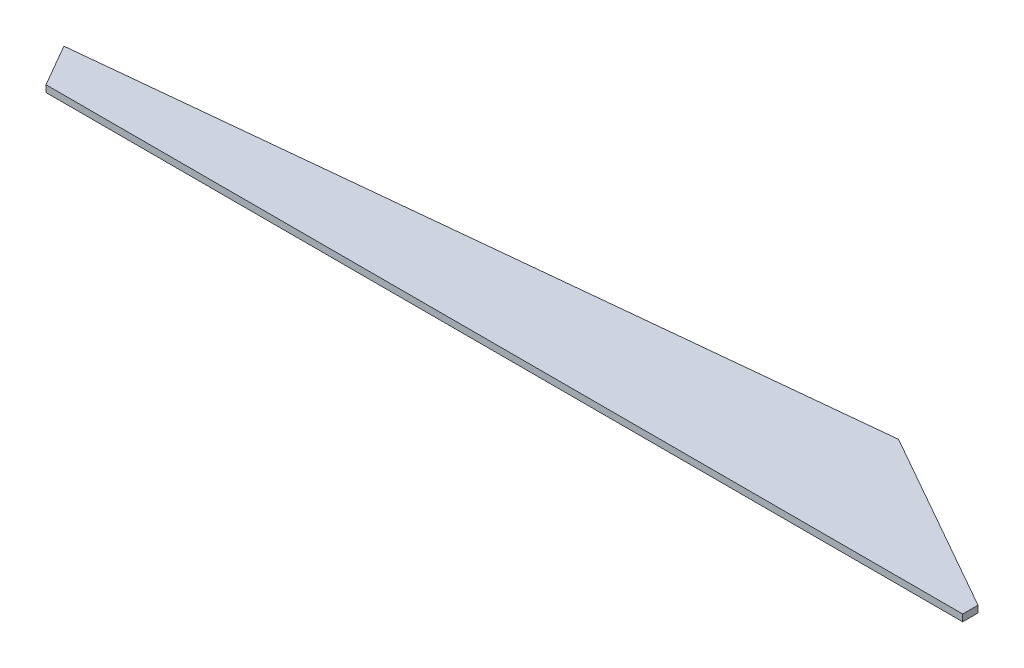
ISO-10303-21;
HEADER;
FILE_DESCRIPTION(('STEP AP214'),'2;1');
FILE_NAME('part.step','',(''),(''),'','','');
FILE_SCHEMA(('AUTOMOTIVE_DESIGN { 1 0 10303 214 1 1 1 1 }'));
ENDSEC;
DATA;
#1=APPLICATION_CONTEXT('core data for automotive mechanical design processes');
#2=APPLICATION_PROTOCOL_DEFINITION('international standard','automotive_design',2000,#1);
#3=PRODUCT_CONTEXT('',#1,'mechanical');
#4=PRODUCT('Part','Part','',(#3));
#5=PRODUCT_RELATED_PRODUCT_CATEGORY('part','',(#4));
#6=PRODUCT_DEFINITION_FORMATION('','',#4);
#7=PRODUCT_DEFINITION_CONTEXT('part definition',#1,'design');
#8=PRODUCT_DEFINITION('design','',#6,#7);
#9=PRODUCT_DEFINITION_SHAPE('','',#8);
#10=(LENGTH_UNIT() NAMED_UNIT(*) SI_UNIT(.MILLI.,.METRE.));
#11=(NAMED_UNIT(*) PLANE_ANGLE_UNIT() SI_UNIT($,.RADIAN.));
#12=(NAMED_UNIT(*) SI_UNIT($,.STERADIAN.) SOLID_ANGLE_UNIT());
#13=UNCERTAINTY_MEASURE_WITH_UNIT(LENGTH_MEASURE(1.E-05),#10,'distance_accuracy_value','');
#14=(GEOMETRIC_REPRESENTATION_CONTEXT(3) GLOBAL_UNCERTAINTY_ASSIGNED_CONTEXT((#13)) GLOBAL_UNIT_ASSIGNED_CONTEXT((#10,
#11,#12)) REPRESENTATION_CONTEXT('',''));
#15=CARTESIAN_POINT('',(0.,0.,0.));
#16=DIRECTION('',(0.,0.,1.));
#17=DIRECTION('',(1.,0.,0.));
#18=AXIS2_PLACEMENT_3D('',#15,#16,#17);
#19=CARTESIAN_POINT('',(48.2548359966362,50.,-85.1555929352391));
#20=DIRECTION('',(0.493012571980885,0.,-0.870022185848609));
#21=DIRECTION('',(-0.870022185848609,0.,-0.493012571980885));
#22=AXIS2_PLACEMENT_3D('',#19,#20,#21);
#23=PLANE('',#22);
#24=DIRECTION('',(0.870022185848609,0.,0.493012571980885));
#25=VECTOR('',#24,1.);
#26=CARTESIAN_POINT('',(48.2548359966362,0.,-85.1555929352391));
#27=LINE('',#26,#25);
#28=CARTESIAN_POINT('',(-1350.,0.,-877.500000000011));
#29=VERTEX_POINT('',#28);
#30=CARTESIAN_POINT('',(0.,0.,-112.5));
#31=VERTEX_POINT('',#30);
#32=EDGE_CURVE('E117',#29,#31,#27,.T.);
#33=ORIENTED_EDGE('',*,*,#32,.F.);
#34=DIRECTION('',(0.,-1.,0.));
#35=VECTOR('',#34,1.);
#36=CARTESIAN_POINT('',(-1350.,50.,-877.500000000011));
#37=LINE('',#36,#35);
#38=CARTESIAN_POINT('',(-1350.,50.,-877.500000000011));
#39=VERTEX_POINT('',#38);
#40=EDGE_CURVE('E11',#39,#29,#37,.T.);
#41=ORIENTED_EDGE('',*,*,#40,.F.);
#42=DIRECTION('',(0.870022185848609,0.,0.493012571980885));
#43=VECTOR('',#42,1.);
#44=CARTESIAN_POINT('',(48.2548359966362,50.,-85.1555929352391));
#45=LINE('',#44,#43);
#46=CARTESIAN_POINT('',(0.,50.,-112.5));
#47=VERTEX_POINT('',#46);
#48=EDGE_CURVE('E133',#39,#47,#45,.T.);
#49=ORIENTED_EDGE('',*,*,#48,.T.);
#50=DIRECTION('',(0.,-1.,0.));
#51=VECTOR('',#50,1.);
#52=CARTESIAN_POINT('',(0.,50.,-112.5));
#53=LINE('',#52,#51);
#54=EDGE_CURVE('E81',#47,#31,#53,.T.);
#55=ORIENTED_EDGE('',*,*,#54,.T.);
#56=EDGE_LOOP('',(#33,#41,#49,#55));
#57=FACE_BOUND('',#56,.T.);
#58=ADVANCED_FACE('F39',(#57),#23,.T.);
#59=CARTESIAN_POINT('',(-101.796041528443,50.,-1004.04972978284));
#60=DIRECTION('',(-0.100868369668265,0.,-0.994899779877585));
#61=DIRECTION('',(-0.994899779877585,0.,0.100868369668265));
#62=AXIS2_PLACEMENT_3D('',#59,#60,#61);
#63=PLANE('',#62);
#64=DIRECTION('',(0.994899779877585,0.,-0.100868369668265));
#65=VECTOR('',#64,1.);
#66=CARTESIAN_POINT('',(-101.796041528443,0.,-1004.04972978284));
#67=LINE('',#66,#65);
#68=CARTESIAN_POINT('',(-6930.,0.,-311.769145362397));
#69=VERTEX_POINT('',#68);
#70=EDGE_CURVE('E121',#69,#29,#67,.T.);
#71=ORIENTED_EDGE('',*,*,#70,.F.);
#72=DIRECTION('',(0.,-1.,0.));
#73=VECTOR('',#72,1.);
#74=CARTESIAN_POINT('',(-6930.,50.,-311.769145362397));
#75=LINE('',#74,#73);
#76=CARTESIAN_POINT('',(-6930.,50.,-311.769145362397));
#77=VERTEX_POINT('',#76);
#78=EDGE_CURVE('E48',#77,#69,#75,.T.);
#79=ORIENTED_EDGE('',*,*,#78,.F.);
#80=DIRECTION('',(0.994899779877585,0.,-0.100868369668265));
#81=VECTOR('',#80,1.);
#82=CARTESIAN_POINT('',(-101.796041528443,50.,-1004.04972978284));
#83=LINE('',#82,#81);
#84=EDGE_CURVE('E107',#77,#39,#83,.T.);
#85=ORIENTED_EDGE('',*,*,#84,.T.);
#86=ORIENTED_EDGE('',*,*,#40,.T.);
#87=EDGE_LOOP('',(#71,#79,#85,#86));
#88=FACE_BOUND('',#87,.T.);
#89=ADVANCED_FACE('F140',(#88),#63,.T.);
#90=CARTESIAN_POINT('',(-5062.49999999998,50.,2922.83573777249));
#91=DIRECTION('',(-0.866025403784437,0.,0.500000000000003));
#92=DIRECTION('',(0.500000000000003,0.,0.866025403784437));
#93=AXIS2_PLACEMENT_3D('',#90,#91,#92);
#94=PLANE('',#93);
#95=DIRECTION('',(-0.500000000000003,0.,-0.866025403784437));
#96=VECTOR('',#95,1.);
#97=CARTESIAN_POINT('',(-5062.49999999998,0.,2922.83573777249));
#98=LINE('',#97,#96);
#99=CARTESIAN_POINT('',(-6750.,0.,8.26636589424463E-13));
#100=VERTEX_POINT('',#99);
#101=EDGE_CURVE('E96',#100,#69,#98,.T.);
#102=ORIENTED_EDGE('',*,*,#101,.F.);
#103=DIRECTION('',(0.,-1.,0.));
#104=VECTOR('',#103,1.);
#105=CARTESIAN_POINT('',(-6750.,50.,8.26636589424463E-13));
#106=LINE('',#105,#104);
#107=CARTESIAN_POINT('',(-6750.,50.,8.26636589424463E-13));
#108=VERTEX_POINT('',#107);
#109=EDGE_CURVE('E91',#108,#100,#106,.T.);
#110=ORIENTED_EDGE('',*,*,#109,.F.);
#111=DIRECTION('',(-0.500000000000003,0.,-0.866025403784437));
#112=VECTOR('',#111,1.);
#113=CARTESIAN_POINT('',(-5062.49999999998,50.,2922.83573777249));
#114=LINE('',#113,#112);
#115=EDGE_CURVE('E94',#108,#77,#114,.T.);
#116=ORIENTED_EDGE('',*,*,#115,.T.);
#117=ORIENTED_EDGE('',*,*,#78,.T.);
#118=EDGE_LOOP('',(#102,#110,#116,#117));
#119=FACE_BOUND('',#118,.T.);
#120=ADVANCED_FACE('F93',(#119),#94,.T.);
#121=CARTESIAN_POINT('',(0.,50.,0.));
#122=DIRECTION('',(0.,0.,1.));
#123=DIRECTION('',(1.,0.,0.));
#124=AXIS2_PLACEMENT_3D('',#121,#122,#123);
#125=PLANE('',#124);
#126=DIRECTION('',(-1.,0.,0.));
#127=VECTOR('',#126,1.);
#128=CARTESIAN_POINT('',(0.,0.,0.));
#129=LINE('',#128,#127);
#130=CARTESIAN_POINT('',(0.,0.,0.));
#131=VERTEX_POINT('',#130);
#132=EDGE_CURVE('E127',#131,#100,#129,.T.);
#133=ORIENTED_EDGE('',*,*,#132,.F.);
#134=DIRECTION('',(0.,-1.,0.));
#135=VECTOR('',#134,1.);
#136=CARTESIAN_POINT('',(0.,50.,0.));
#137=LINE('',#136,#135);
#138=CARTESIAN_POINT('',(0.,50.,0.));
#139=VERTEX_POINT('',#138);
#140=EDGE_CURVE('E74',#139,#131,#137,.T.);
#141=ORIENTED_EDGE('',*,*,#140,.F.);
#142=DIRECTION('',(-1.,0.,0.));
#143=VECTOR('',#142,1.);
#144=CARTESIAN_POINT('',(0.,50.,0.));
#145=LINE('',#144,#143);
#146=EDGE_CURVE('E105',#139,#108,#145,.T.);
#147=ORIENTED_EDGE('',*,*,#146,.T.);
#148=ORIENTED_EDGE('',*,*,#109,.T.);
#149=EDGE_LOOP('',(#133,#141,#147,#148));
#150=FACE_BOUND('',#149,.T.);
#151=ADVANCED_FACE('F110',(#150),#125,.T.);
#152=CARTESIAN_POINT('',(0.,50.,0.));
#153=DIRECTION('',(-1.,0.,0.));
#154=DIRECTION('',(0.,0.,1.));
#155=AXIS2_PLACEMENT_3D('',#152,#153,#154);
#156=PLANE('',#155);
#157=DIRECTION('',(0.,0.,-1.));
#158=VECTOR('',#157,1.);
#159=CARTESIAN_POINT('',(0.,0.,0.));
#160=LINE('',#159,#158);
#161=EDGE_CURVE('E130',#131,#31,#160,.T.);
#162=ORIENTED_EDGE('',*,*,#161,.T.);
#163=ORIENTED_EDGE('',*,*,#54,.F.);
#164=DIRECTION('',(0.,0.,-1.));
#165=VECTOR('',#164,1.);
#166=CARTESIAN_POINT('',(0.,50.,0.));
#167=LINE('',#166,#165);
#168=EDGE_CURVE('E56',#139,#47,#167,.T.);
#169=ORIENTED_EDGE('',*,*,#168,.F.);
#170=ORIENTED_EDGE('',*,*,#140,.T.);
#171=EDGE_LOOP('',(#162,#163,#169,#170));
#172=FACE_BOUND('',#171,.T.);
#173=ADVANCED_FACE('F143',(#172),#156,.F.);
#174=CARTESIAN_POINT('',(0.,50.,0.));
#175=DIRECTION('',(0.,1.,0.));
#176=DIRECTION('',(0.,0.,1.));
#177=AXIS2_PLACEMENT_3D('',#174,#175,#176);
#178=PLANE('',#177);
#179=ORIENTED_EDGE('',*,*,#48,.F.);
#180=ORIENTED_EDGE('',*,*,#84,.F.);
#181=ORIENTED_EDGE('',*,*,#115,.F.);
#182=ORIENTED_EDGE('',*,*,#146,.F.);
#183=ORIENTED_EDGE('',*,*,#168,.T.);
#184=EDGE_LOOP('',(#179,#180,#181,#182,#183));
#185=FACE_BOUND('',#184,.T.);
#186=ADVANCED_FACE('F104',(#185),#178,.T.);
#187=CARTESIAN_POINT('',(0.,0.,0.));
#188=DIRECTION('',(0.,1.,0.));
#189=DIRECTION('',(0.,0.,1.));
#190=AXIS2_PLACEMENT_3D('',#187,#188,#189);
#191=PLANE('',#190);
#192=ORIENTED_EDGE('',*,*,#32,.T.);
#193=ORIENTED_EDGE('',*,*,#161,.F.);
#194=ORIENTED_EDGE('',*,*,#132,.T.);
#195=ORIENTED_EDGE('',*,*,#101,.T.);
#196=ORIENTED_EDGE('',*,*,#70,.T.);
#197=EDGE_LOOP('',(#192,#193,#194,#195,#196));
#198=FACE_BOUND('',#197,.T.);
#199=ADVANCED_FACE('F142',(#198),#191,.F.);
#200=CLOSED_SHELL('',(#58,#89,#120,#151,#173,#186,#199));
#201=MANIFOLD_SOLID_BREP('B2',#200);
#202=ADVANCED_BREP_SHAPE_REPRESENTATION('',(#18,#201),#14);
#203=SHAPE_DEFINITION_REPRESENTATION(#9,#202);
ENDSEC;
END-ISO-10303-21;
